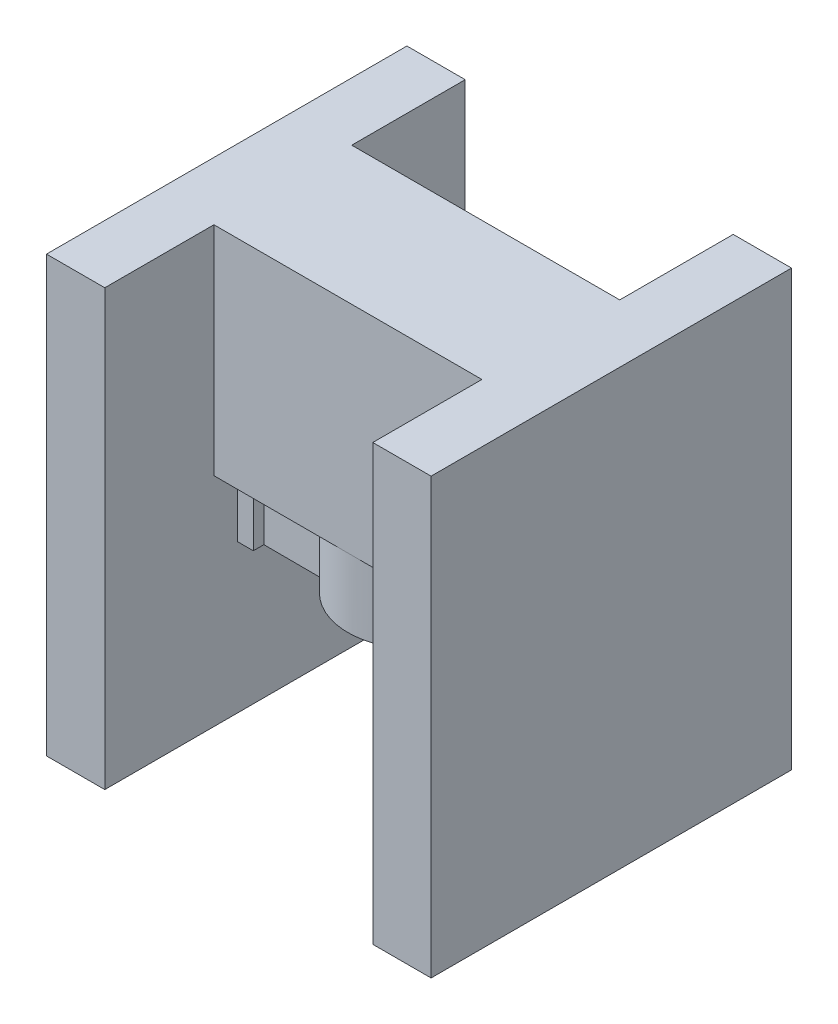
ISO-10303-21;
HEADER;
FILE_DESCRIPTION(('STEP AP214'),'2;1');
FILE_NAME('part.step','',(''),(''),'','','');
FILE_SCHEMA(('AUTOMOTIVE_DESIGN { 1 0 10303 214 1 1 1 1 }'));
ENDSEC;
DATA;
#1=APPLICATION_CONTEXT('core data for automotive mechanical design processes');
#2=APPLICATION_PROTOCOL_DEFINITION('international standard','automotive_design',2000,#1);
#3=PRODUCT_CONTEXT('',#1,'mechanical');
#4=PRODUCT('Part','Part','',(#3));
#5=PRODUCT_RELATED_PRODUCT_CATEGORY('part','',(#4));
#6=PRODUCT_DEFINITION_FORMATION('','',#4);
#7=PRODUCT_DEFINITION_CONTEXT('part definition',#1,'design');
#8=PRODUCT_DEFINITION('design','',#6,#7);
#9=PRODUCT_DEFINITION_SHAPE('','',#8);
#10=(LENGTH_UNIT() NAMED_UNIT(*) SI_UNIT(.MILLI.,.METRE.));
#11=(NAMED_UNIT(*) PLANE_ANGLE_UNIT() SI_UNIT($,.RADIAN.));
#12=(NAMED_UNIT(*) SI_UNIT($,.STERADIAN.) SOLID_ANGLE_UNIT());
#13=UNCERTAINTY_MEASURE_WITH_UNIT(LENGTH_MEASURE(1.E-05),#10,'distance_accuracy_value','');
#14=(GEOMETRIC_REPRESENTATION_CONTEXT(3) GLOBAL_UNCERTAINTY_ASSIGNED_CONTEXT((#13)) GLOBAL_UNIT_ASSIGNED_CONTEXT((#10,
#11,#12)) REPRESENTATION_CONTEXT('',''));
#15=CARTESIAN_POINT('',(0.,0.,0.));
#16=DIRECTION('',(0.,0.,1.));
#17=DIRECTION('',(1.,0.,0.));
#18=AXIS2_PLACEMENT_3D('',#15,#16,#17);
#19=CARTESIAN_POINT('',(19.2722093874877,13.,-34.4308827580366));
#20=DIRECTION('',(-1.,0.,0.));
#21=DIRECTION('',(0.,0.,1.));
#22=AXIS2_PLACEMENT_3D('',#19,#20,#21);
#23=PLANE('',#22);
#24=DIRECTION('',(0.,0.,-1.));
#25=VECTOR('',#24,1.);
#26=CARTESIAN_POINT('',(19.2722093874877,6.5,-34.4308827580366));
#27=LINE('',#26,#25);
#28=CARTESIAN_POINT('',(19.2722093874877,6.5,-33.4308827580366));
#29=VERTEX_POINT('',#28);
#30=CARTESIAN_POINT('',(19.2722093874877,6.5,-34.4308827580366));
#31=VERTEX_POINT('',#30);
#32=EDGE_CURVE('E447',#29,#31,#27,.T.);
#33=ORIENTED_EDGE('',*,*,#32,.F.);
#34=DIRECTION('',(0.,-1.,0.));
#35=VECTOR('',#34,1.);
#36=CARTESIAN_POINT('',(19.2722093874877,13.,-33.4308827580366));
#37=LINE('',#36,#35);
#38=CARTESIAN_POINT('',(19.2722093874877,0.,-33.4308827580366));
#39=VERTEX_POINT('',#38);
#40=EDGE_CURVE('E49',#29,#39,#37,.T.);
#41=ORIENTED_EDGE('',*,*,#40,.T.);
#42=DIRECTION('',(0.,0.,-1.));
#43=VECTOR('',#42,1.);
#44=CARTESIAN_POINT('',(19.2722093874877,0.,-34.4308827580366));
#45=LINE('',#44,#43);
#46=CARTESIAN_POINT('',(19.2722093874877,0.,-34.4308827580366));
#47=VERTEX_POINT('',#46);
#48=EDGE_CURVE('E272',#39,#47,#45,.T.);
#49=ORIENTED_EDGE('',*,*,#48,.T.);
#50=DIRECTION('',(0.,-1.,0.));
#51=VECTOR('',#50,1.);
#52=CARTESIAN_POINT('',(19.2722093874877,13.,-34.4308827580366));
#53=LINE('',#52,#51);
#54=EDGE_CURVE('E351',#31,#47,#53,.T.);
#55=ORIENTED_EDGE('',*,*,#54,.F.);
#56=EDGE_LOOP('',(#33,#41,#49,#55));
#57=FACE_BOUND('',#56,.T.);
#58=ADVANCED_FACE('F32',(#57),#23,.F.);
#59=CARTESIAN_POINT('',(24.8199710298214,13.,-34.4097664918062));
#60=DIRECTION('',(0.00380624017948746,0.,-0.999992756241612));
#61=DIRECTION('',(-0.999992756241612,0.,-0.00380624017948746));
#62=AXIS2_PLACEMENT_3D('',#59,#60,#61);
#63=PLANE('',#62);
#64=DIRECTION('',(0.999992756241612,0.,0.00380624017948746));
#65=VECTOR('',#64,1.);
#66=CARTESIAN_POINT('',(24.8199710298214,6.5,-34.4097664918062));
#67=LINE('',#66,#65);
#68=CARTESIAN_POINT('',(24.8199710298214,6.5,-34.4097664918062));
#69=VERTEX_POINT('',#68);
#70=EDGE_CURVE('E445',#31,#69,#67,.T.);
#71=ORIENTED_EDGE('',*,*,#70,.F.);
#72=ORIENTED_EDGE('',*,*,#54,.T.);
#73=DIRECTION('',(0.999992756241612,0.,0.00380624017948746));
#74=VECTOR('',#73,1.);
#75=CARTESIAN_POINT('',(24.8199710298214,0.,-34.4097664918062));
#76=LINE('',#75,#74);
#77=CARTESIAN_POINT('',(24.8199710298214,0.,-34.4097664918062));
#78=VERTEX_POINT('',#77);
#79=EDGE_CURVE('E274',#47,#78,#76,.T.);
#80=ORIENTED_EDGE('',*,*,#79,.T.);
#81=DIRECTION('',(0.,-1.,0.));
#82=VECTOR('',#81,1.);
#83=CARTESIAN_POINT('',(24.8199710298214,13.,-34.4097664918062));
#84=LINE('',#83,#82);
#85=EDGE_CURVE('E349',#69,#78,#84,.T.);
#86=ORIENTED_EDGE('',*,*,#85,.F.);
#87=EDGE_LOOP('',(#71,#72,#80,#86));
#88=FACE_BOUND('',#87,.T.);
#89=ADVANCED_FACE('F544',(#88),#63,.F.);
#90=CARTESIAN_POINT('',(30.4201919048927,13.,-37.7093916448222));
#91=DIRECTION('',(0.,-1.,0.));
#92=DIRECTION('',(0.,0.,-1.));
#93=AXIS2_PLACEMENT_3D('',#90,#91,#92);
#94=CYLINDRICAL_SURFACE('',#93,6.5);
#95=CARTESIAN_POINT('',(30.4201919048927,6.5,-37.7093916448222));
#96=DIRECTION('',(0.,1.,0.));
#97=DIRECTION('',(0.,0.,1.));
#98=AXIS2_PLACEMENT_3D('',#95,#96,#97);
#99=CIRCLE('',#98,6.5);
#100=CARTESIAN_POINT('',(30.4201919048927,6.5,-31.2093916448222));
#101=VERTEX_POINT('',#100);
#102=CARTESIAN_POINT('',(36.0204127799639,6.5,-34.4097664918062));
#103=VERTEX_POINT('',#102);
#104=EDGE_CURVE('E442',#101,#103,#99,.T.);
#105=ORIENTED_EDGE('',*,*,#104,.F.);
#106=EDGE_CURVE('E443',#69,#101,#99,.T.);
#107=ORIENTED_EDGE('',*,*,#106,.F.);
#108=ORIENTED_EDGE('',*,*,#85,.T.);
#109=CARTESIAN_POINT('',(30.4201919048927,0.,-37.7093916448222));
#110=DIRECTION('',(0.,1.,0.));
#111=DIRECTION('',(0.,0.,1.));
#112=AXIS2_PLACEMENT_3D('',#109,#110,#111);
#113=CIRCLE('',#112,6.5);
#114=CARTESIAN_POINT('',(36.0204127799639,0.,-34.4097664918062));
#115=VERTEX_POINT('',#114);
#116=EDGE_CURVE('E277',#78,#115,#113,.T.);
#117=ORIENTED_EDGE('',*,*,#116,.T.);
#118=DIRECTION('',(0.,-1.,0.));
#119=VECTOR('',#118,1.);
#120=CARTESIAN_POINT('',(36.0204127799639,13.,-34.4097664918062));
#121=LINE('',#120,#119);
#122=EDGE_CURVE('E347',#103,#115,#121,.T.);
#123=ORIENTED_EDGE('',*,*,#122,.F.);
#124=EDGE_LOOP('',(#105,#107,#108,#117,#123));
#125=FACE_BOUND('',#124,.T.);
#126=ADVANCED_FACE('F470',(#125),#94,.T.);
#127=CARTESIAN_POINT('',(36.0204127799639,13.,-34.4097664918062));
#128=DIRECTION('',(-0.00380624017948746,0.,-0.999992756241612));
#129=DIRECTION('',(-0.999992756241612,0.,0.00380624017948746));
#130=AXIS2_PLACEMENT_3D('',#127,#128,#129);
#131=PLANE('',#130);
#132=DIRECTION('',(0.999992756241612,0.,-0.00380624017948746));
#133=VECTOR('',#132,1.);
#134=CARTESIAN_POINT('',(36.0204127799639,6.5,-34.4097664918062));
#135=LINE('',#134,#133);
#136=CARTESIAN_POINT('',(41.5681744222976,6.5,-34.4308827580366));
#137=VERTEX_POINT('',#136);
#138=EDGE_CURVE('E440',#103,#137,#135,.T.);
#139=ORIENTED_EDGE('',*,*,#138,.F.);
#140=ORIENTED_EDGE('',*,*,#122,.T.);
#141=DIRECTION('',(0.999992756241612,0.,-0.00380624017948746));
#142=VECTOR('',#141,1.);
#143=CARTESIAN_POINT('',(36.0204127799639,0.,-34.4097664918062));
#144=LINE('',#143,#142);
#145=CARTESIAN_POINT('',(41.5681744222976,0.,-34.4308827580366));
#146=VERTEX_POINT('',#145);
#147=EDGE_CURVE('E280',#115,#146,#144,.T.);
#148=ORIENTED_EDGE('',*,*,#147,.T.);
#149=DIRECTION('',(0.,-1.,0.));
#150=VECTOR('',#149,1.);
#151=CARTESIAN_POINT('',(41.5681744222976,13.,-34.4308827580366));
#152=LINE('',#151,#150);
#153=EDGE_CURVE('E35',#137,#146,#152,.T.);
#154=ORIENTED_EDGE('',*,*,#153,.F.);
#155=EDGE_LOOP('',(#139,#140,#148,#154));
#156=FACE_BOUND('',#155,.T.);
#157=ADVANCED_FACE('F478',(#156),#131,.F.);
#158=CARTESIAN_POINT('',(41.5681744222976,13.,-34.4308827580366));
#159=DIRECTION('',(1.,0.,0.));
#160=DIRECTION('',(0.,0.,-1.));
#161=AXIS2_PLACEMENT_3D('',#158,#159,#160);
#162=PLANE('',#161);
#163=DIRECTION('',(0.,0.,1.));
#164=VECTOR('',#163,1.);
#165=CARTESIAN_POINT('',(41.5681744222976,6.5,-34.4308827580366));
#166=LINE('',#165,#164);
#167=CARTESIAN_POINT('',(41.5681744222976,6.5,-33.4308827580366));
#168=VERTEX_POINT('',#167);
#169=EDGE_CURVE('E438',#137,#168,#166,.T.);
#170=ORIENTED_EDGE('',*,*,#169,.F.);
#171=ORIENTED_EDGE('',*,*,#153,.T.);
#172=DIRECTION('',(0.,0.,1.));
#173=VECTOR('',#172,1.);
#174=CARTESIAN_POINT('',(41.5681744222976,0.,-34.4308827580366));
#175=LINE('',#174,#173);
#176=CARTESIAN_POINT('',(41.5681744222976,0.,-33.4308827580366));
#177=VERTEX_POINT('',#176);
#178=EDGE_CURVE('E283',#146,#177,#175,.T.);
#179=ORIENTED_EDGE('',*,*,#178,.T.);
#180=DIRECTION('',(0.,-1.,0.));
#181=VECTOR('',#180,1.);
#182=CARTESIAN_POINT('',(41.5681744222976,13.,-33.4308827580366));
#183=LINE('',#182,#181);
#184=EDGE_CURVE('E346',#168,#177,#183,.T.);
#185=ORIENTED_EDGE('',*,*,#184,.F.);
#186=EDGE_LOOP('',(#170,#171,#179,#185));
#187=FACE_BOUND('',#186,.T.);
#188=ADVANCED_FACE('F482',(#187),#162,.F.);
#189=CARTESIAN_POINT('',(43.0606961626799,13.,-33.4308827580366));
#190=DIRECTION('',(0.,0.,-1.));
#191=DIRECTION('',(-1.,0.,0.));
#192=AXIS2_PLACEMENT_3D('',#189,#190,#191);
#193=PLANE('',#192);
#194=DIRECTION('',(1.,0.,0.));
#195=VECTOR('',#194,1.);
#196=CARTESIAN_POINT('',(43.0606961626799,6.5,-33.4308827580366));
#197=LINE('',#196,#195);
#198=CARTESIAN_POINT('',(43.0606961626799,6.5,-33.4308827580366));
#199=VERTEX_POINT('',#198);
#200=EDGE_CURVE('E436',#168,#199,#197,.T.);
#201=ORIENTED_EDGE('',*,*,#200,.F.);
#202=ORIENTED_EDGE('',*,*,#184,.T.);
#203=DIRECTION('',(1.,0.,0.));
#204=VECTOR('',#203,1.);
#205=CARTESIAN_POINT('',(43.0606961626799,0.,-33.4308827580366));
#206=LINE('',#205,#204);
#207=CARTESIAN_POINT('',(43.0606961626799,0.,-33.4308827580366));
#208=VERTEX_POINT('',#207);
#209=EDGE_CURVE('E286',#177,#208,#206,.T.);
#210=ORIENTED_EDGE('',*,*,#209,.T.);
#211=DIRECTION('',(0.,-1.,0.));
#212=VECTOR('',#211,1.);
#213=CARTESIAN_POINT('',(43.0606961626799,13.,-33.4308827580366));
#214=LINE('',#213,#212);
#215=EDGE_CURVE('E344',#199,#208,#214,.T.);
#216=ORIENTED_EDGE('',*,*,#215,.F.);
#217=EDGE_LOOP('',(#201,#202,#210,#216));
#218=FACE_BOUND('',#217,.T.);
#219=ADVANCED_FACE('F489',(#218),#193,.F.);
#220=CARTESIAN_POINT('',(43.0606961626799,13.,-42.2352624916838));
#221=DIRECTION('',(0.,0.,1.));
#222=DIRECTION('',(1.,0.,0.));
#223=AXIS2_PLACEMENT_3D('',#220,#221,#222);
#224=PLANE('',#223);
#225=DIRECTION('',(-1.,0.,0.));
#226=VECTOR('',#225,1.);
#227=CARTESIAN_POINT('',(43.0606961626799,6.5,-42.2352624916838));
#228=LINE('',#227,#226);
#229=CARTESIAN_POINT('',(43.0606961626799,6.5,-42.2352624916838));
#230=VERTEX_POINT('',#229);
#231=CARTESIAN_POINT('',(41.5681744222976,6.5,-42.2352624916838));
#232=VERTEX_POINT('',#231);
#233=EDGE_CURVE('E418',#230,#232,#228,.T.);
#234=ORIENTED_EDGE('',*,*,#233,.F.);
#235=DIRECTION('',(0.,-1.,0.));
#236=VECTOR('',#235,1.);
#237=CARTESIAN_POINT('',(43.0606961626799,13.,-42.2352624916838));
#238=LINE('',#237,#236);
#239=CARTESIAN_POINT('',(43.0606961626799,0.,-42.2352624916838));
#240=VERTEX_POINT('',#239);
#241=EDGE_CURVE('E333',#230,#240,#238,.T.);
#242=ORIENTED_EDGE('',*,*,#241,.T.);
#243=DIRECTION('',(-1.,0.,0.));
#244=VECTOR('',#243,1.);
#245=CARTESIAN_POINT('',(43.0606961626799,0.,-42.2352624916838));
#246=LINE('',#245,#244);
#247=CARTESIAN_POINT('',(41.5681744222976,0.,-42.2352624916838));
#248=VERTEX_POINT('',#247);
#249=EDGE_CURVE('E289',#240,#248,#246,.T.);
#250=ORIENTED_EDGE('',*,*,#249,.T.);
#251=DIRECTION('',(0.,-1.,0.));
#252=VECTOR('',#251,1.);
#253=CARTESIAN_POINT('',(41.5681744222976,13.,-42.2352624916838));
#254=LINE('',#253,#252);
#255=EDGE_CURVE('E336',#232,#248,#254,.T.);
#256=ORIENTED_EDGE('',*,*,#255,.F.);
#257=EDGE_LOOP('',(#234,#242,#250,#256));
#258=FACE_BOUND('',#257,.T.);
#259=ADVANCED_FACE('F503',(#258),#224,.F.);
#260=CARTESIAN_POINT('',(41.5681744222976,13.,-42.2352624916838));
#261=DIRECTION('',(1.,0.,0.));
#262=DIRECTION('',(0.,0.,-1.));
#263=AXIS2_PLACEMENT_3D('',#260,#261,#262);
#264=PLANE('',#263);
#265=DIRECTION('',(0.,0.,1.));
#266=VECTOR('',#265,1.);
#267=CARTESIAN_POINT('',(41.5681744222976,6.5,-42.2352624916838));
#268=LINE('',#267,#266);
#269=CARTESIAN_POINT('',(41.5681744222976,6.5,-40.8600221258481));
#270=VERTEX_POINT('',#269);
#271=EDGE_CURVE('E420',#232,#270,#268,.T.);
#272=ORIENTED_EDGE('',*,*,#271,.F.);
#273=ORIENTED_EDGE('',*,*,#255,.T.);
#274=DIRECTION('',(0.,0.,1.));
#275=VECTOR('',#274,1.);
#276=CARTESIAN_POINT('',(41.5681744222976,0.,-42.2352624916838));
#277=LINE('',#276,#275);
#278=CARTESIAN_POINT('',(41.5681744222976,0.,-40.8600221258481));
#279=VERTEX_POINT('',#278);
#280=EDGE_CURVE('E292',#248,#279,#277,.T.);
#281=ORIENTED_EDGE('',*,*,#280,.T.);
#282=DIRECTION('',(0.,-1.,0.));
#283=VECTOR('',#282,1.);
#284=CARTESIAN_POINT('',(41.5681744222976,13.,-40.8600221258481));
#285=LINE('',#284,#283);
#286=EDGE_CURVE('E332',#270,#279,#285,.T.);
#287=ORIENTED_EDGE('',*,*,#286,.F.);
#288=EDGE_LOOP('',(#272,#273,#281,#287));
#289=FACE_BOUND('',#288,.T.);
#290=ADVANCED_FACE('F576',(#289),#264,.F.);
#291=CARTESIAN_POINT('',(41.5681744222976,13.,-40.8600221258481));
#292=DIRECTION('',(0.,0.,1.));
#293=DIRECTION('',(1.,0.,0.));
#294=AXIS2_PLACEMENT_3D('',#291,#292,#293);
#295=PLANE('',#294);
#296=DIRECTION('',(-1.,0.,0.));
#297=VECTOR('',#296,1.);
#298=CARTESIAN_POINT('',(41.5681744222976,6.5,-40.8600221258481));
#299=LINE('',#298,#297);
#300=CARTESIAN_POINT('',(36.1055703067258,6.5,-40.8600221258481));
#301=VERTEX_POINT('',#300);
#302=EDGE_CURVE('E422',#270,#301,#299,.T.);
#303=ORIENTED_EDGE('',*,*,#302,.F.);
#304=ORIENTED_EDGE('',*,*,#286,.T.);
#305=DIRECTION('',(-1.,0.,0.));
#306=VECTOR('',#305,1.);
#307=CARTESIAN_POINT('',(41.5681744222976,0.,-40.8600221258481));
#308=LINE('',#307,#306);
#309=CARTESIAN_POINT('',(36.1055703067258,0.,-40.8600221258481));
#310=VERTEX_POINT('',#309);
#311=EDGE_CURVE('E295',#279,#310,#308,.T.);
#312=ORIENTED_EDGE('',*,*,#311,.T.);
#313=DIRECTION('',(0.,-1.,0.));
#314=VECTOR('',#313,1.);
#315=CARTESIAN_POINT('',(36.1055703067258,13.,-40.8600221258481));
#316=LINE('',#315,#314);
#317=EDGE_CURVE('E330',#301,#310,#316,.T.);
#318=ORIENTED_EDGE('',*,*,#317,.F.);
#319=EDGE_LOOP('',(#303,#304,#312,#318));
#320=FACE_BOUND('',#319,.T.);
#321=ADVANCED_FACE('F579',(#320),#295,.F.);
#322=CARTESIAN_POINT('',(30.4201919048927,13.,-37.7093916448222));
#323=DIRECTION('',(0.,-1.,0.));
#324=DIRECTION('',(0.,0.,-1.));
#325=AXIS2_PLACEMENT_3D('',#322,#323,#324);
#326=CYLINDRICAL_SURFACE('',#325,6.5);
#327=CARTESIAN_POINT('',(30.4201919048927,6.5,-37.7093916448222));
#328=DIRECTION('',(0.,1.,0.));
#329=DIRECTION('',(0.,0.,1.));
#330=AXIS2_PLACEMENT_3D('',#327,#328,#329);
#331=CIRCLE('',#330,6.5);
#332=CARTESIAN_POINT('',(30.4201919048927,6.5,-44.2093916448222));
#333=VERTEX_POINT('',#332);
#334=EDGE_CURVE('E424',#301,#333,#331,.T.);
#335=ORIENTED_EDGE('',*,*,#334,.F.);
#336=ORIENTED_EDGE('',*,*,#317,.T.);
#337=CARTESIAN_POINT('',(30.4201919048927,0.,-37.7093916448222));
#338=DIRECTION('',(0.,1.,0.));
#339=DIRECTION('',(0.,0.,1.));
#340=AXIS2_PLACEMENT_3D('',#337,#338,#339);
#341=CIRCLE('',#340,6.5);
#342=CARTESIAN_POINT('',(24.7348135030595,0.,-40.8600221258481));
#343=VERTEX_POINT('',#342);
#344=EDGE_CURVE('E298',#310,#343,#341,.T.);
#345=ORIENTED_EDGE('',*,*,#344,.T.);
#346=DIRECTION('',(0.,-1.,0.));
#347=VECTOR('',#346,1.);
#348=CARTESIAN_POINT('',(24.7348135030595,13.,-40.8600221258481));
#349=LINE('',#348,#347);
#350=CARTESIAN_POINT('',(24.7348135030596,6.5,-40.8600221258481));
#351=VERTEX_POINT('',#350);
#352=EDGE_CURVE('E328',#351,#343,#349,.T.);
#353=ORIENTED_EDGE('',*,*,#352,.F.);
#354=EDGE_CURVE('E425',#333,#351,#331,.T.);
#355=ORIENTED_EDGE('',*,*,#354,.F.);
#356=EDGE_LOOP('',(#335,#336,#345,#353,#355));
#357=FACE_BOUND('',#356,.T.);
#358=ADVANCED_FACE('F517',(#357),#326,.T.);
#359=CARTESIAN_POINT('',(19.2722093874877,13.,-40.8600221258481));
#360=DIRECTION('',(0.,0.,1.));
#361=DIRECTION('',(1.,0.,0.));
#362=AXIS2_PLACEMENT_3D('',#359,#360,#361);
#363=PLANE('',#362);
#364=DIRECTION('',(-1.,0.,0.));
#365=VECTOR('',#364,1.);
#366=CARTESIAN_POINT('',(19.2722093874877,6.5,-40.8600221258481));
#367=LINE('',#366,#365);
#368=CARTESIAN_POINT('',(19.2722093874877,6.5,-40.8600221258481));
#369=VERTEX_POINT('',#368);
#370=EDGE_CURVE('E427',#351,#369,#367,.T.);
#371=ORIENTED_EDGE('',*,*,#370,.F.);
#372=ORIENTED_EDGE('',*,*,#352,.T.);
#373=DIRECTION('',(-1.,0.,0.));
#374=VECTOR('',#373,1.);
#375=CARTESIAN_POINT('',(19.2722093874877,0.,-40.8600221258481));
#376=LINE('',#375,#374);
#377=CARTESIAN_POINT('',(19.2722093874877,0.,-40.8600221258481));
#378=VERTEX_POINT('',#377);
#379=EDGE_CURVE('E301',#343,#378,#376,.T.);
#380=ORIENTED_EDGE('',*,*,#379,.T.);
#381=DIRECTION('',(0.,-1.,0.));
#382=VECTOR('',#381,1.);
#383=CARTESIAN_POINT('',(19.2722093874877,13.,-40.8600221258481));
#384=LINE('',#383,#382);
#385=EDGE_CURVE('E326',#369,#378,#384,.T.);
#386=ORIENTED_EDGE('',*,*,#385,.F.);
#387=EDGE_LOOP('',(#371,#372,#380,#386));
#388=FACE_BOUND('',#387,.T.);
#389=ADVANCED_FACE('F525',(#388),#363,.F.);
#390=CARTESIAN_POINT('',(19.2722093874877,13.,-42.2352624916838));
#391=DIRECTION('',(-1.,0.,0.));
#392=DIRECTION('',(0.,0.,1.));
#393=AXIS2_PLACEMENT_3D('',#390,#391,#392);
#394=PLANE('',#393);
#395=DIRECTION('',(0.,0.,-1.));
#396=VECTOR('',#395,1.);
#397=CARTESIAN_POINT('',(19.2722093874877,6.5,-42.2352624916838));
#398=LINE('',#397,#396);
#399=CARTESIAN_POINT('',(19.2722093874877,6.5,-42.2352624916838));
#400=VERTEX_POINT('',#399);
#401=EDGE_CURVE('E429',#369,#400,#398,.T.);
#402=ORIENTED_EDGE('',*,*,#401,.F.);
#403=ORIENTED_EDGE('',*,*,#385,.T.);
#404=DIRECTION('',(0.,0.,-1.));
#405=VECTOR('',#404,1.);
#406=CARTESIAN_POINT('',(19.2722093874877,0.,-42.2352624916838));
#407=LINE('',#406,#405);
#408=CARTESIAN_POINT('',(19.2722093874877,0.,-42.2352624916838));
#409=VERTEX_POINT('',#408);
#410=EDGE_CURVE('E304',#378,#409,#407,.T.);
#411=ORIENTED_EDGE('',*,*,#410,.T.);
#412=DIRECTION('',(0.,-1.,0.));
#413=VECTOR('',#412,1.);
#414=CARTESIAN_POINT('',(19.2722093874877,13.,-42.2352624916838));
#415=LINE('',#414,#413);
#416=EDGE_CURVE('E324',#400,#409,#415,.T.);
#417=ORIENTED_EDGE('',*,*,#416,.F.);
#418=EDGE_LOOP('',(#402,#403,#411,#417));
#419=FACE_BOUND('',#418,.T.);
#420=ADVANCED_FACE('F529',(#419),#394,.F.);
#421=CARTESIAN_POINT('',(17.7796876471054,13.,-42.2352624916838));
#422=DIRECTION('',(0.,0.,1.));
#423=DIRECTION('',(1.,0.,0.));
#424=AXIS2_PLACEMENT_3D('',#421,#422,#423);
#425=PLANE('',#424);
#426=DIRECTION('',(-1.,0.,0.));
#427=VECTOR('',#426,1.);
#428=CARTESIAN_POINT('',(17.7796876471054,6.5,-42.2352624916838));
#429=LINE('',#428,#427);
#430=CARTESIAN_POINT('',(17.7796876471054,6.5,-42.2352624916838));
#431=VERTEX_POINT('',#430);
#432=EDGE_CURVE('E431',#400,#431,#429,.T.);
#433=ORIENTED_EDGE('',*,*,#432,.F.);
#434=ORIENTED_EDGE('',*,*,#416,.T.);
#435=DIRECTION('',(-1.,0.,0.));
#436=VECTOR('',#435,1.);
#437=CARTESIAN_POINT('',(17.7796876471054,0.,-42.2352624916838));
#438=LINE('',#437,#436);
#439=CARTESIAN_POINT('',(17.7796876471054,0.,-42.2352624916838));
#440=VERTEX_POINT('',#439);
#441=EDGE_CURVE('E307',#409,#440,#438,.T.);
#442=ORIENTED_EDGE('',*,*,#441,.T.);
#443=DIRECTION('',(0.,-1.,0.));
#444=VECTOR('',#443,1.);
#445=CARTESIAN_POINT('',(17.7796876471054,13.,-42.2352624916838));
#446=LINE('',#445,#444);
#447=EDGE_CURVE('E322',#431,#440,#446,.T.);
#448=ORIENTED_EDGE('',*,*,#447,.F.);
#449=EDGE_LOOP('',(#433,#434,#442,#448));
#450=FACE_BOUND('',#449,.T.);
#451=ADVANCED_FACE('F536',(#450),#425,.F.);
#452=CARTESIAN_POINT('',(17.7796876471054,13.,-33.4308827580366));
#453=DIRECTION('',(0.,0.,-1.));
#454=DIRECTION('',(-1.,0.,0.));
#455=AXIS2_PLACEMENT_3D('',#452,#453,#454);
#456=PLANE('',#455);
#457=DIRECTION('',(1.,0.,0.));
#458=VECTOR('',#457,1.);
#459=CARTESIAN_POINT('',(17.7796876471054,6.5,-33.4308827580366));
#460=LINE('',#459,#458);
#461=CARTESIAN_POINT('',(17.7796876471054,6.5,-33.4308827580366));
#462=VERTEX_POINT('',#461);
#463=EDGE_CURVE('E11',#462,#29,#460,.T.);
#464=ORIENTED_EDGE('',*,*,#463,.F.);
#465=DIRECTION('',(0.,-1.,0.));
#466=VECTOR('',#465,1.);
#467=CARTESIAN_POINT('',(17.7796876471054,13.,-33.4308827580366));
#468=LINE('',#467,#466);
#469=CARTESIAN_POINT('',(17.7796876471054,0.,-33.4308827580366));
#470=VERTEX_POINT('',#469);
#471=EDGE_CURVE('E56',#462,#470,#468,.T.);
#472=ORIENTED_EDGE('',*,*,#471,.T.);
#473=DIRECTION('',(1.,0.,0.));
#474=VECTOR('',#473,1.);
#475=CARTESIAN_POINT('',(17.7796876471054,0.,-33.4308827580366));
#476=LINE('',#475,#474);
#477=EDGE_CURVE('E310',#470,#39,#476,.T.);
#478=ORIENTED_EDGE('',*,*,#477,.T.);
#479=ORIENTED_EDGE('',*,*,#40,.F.);
#480=EDGE_LOOP('',(#464,#472,#478,#479));
#481=FACE_BOUND('',#480,.T.);
#482=ADVANCED_FACE('F539',(#481),#456,.F.);
#483=CARTESIAN_POINT('',(30.4201919048927,0.,-37.7093916448222));
#484=DIRECTION('',(0.,1.,0.));
#485=DIRECTION('',(0.,0.,1.));
#486=AXIS2_PLACEMENT_3D('',#483,#484,#485);
#487=PLANE('',#486);
#488=CARTESIAN_POINT('',(30.4201919048927,0.,-37.7093916448222));
#489=DIRECTION('',(0.,1.,0.));
#490=DIRECTION('',(0.,0.,1.));
#491=AXIS2_PLACEMENT_3D('',#488,#489,#490);
#492=CIRCLE('',#491,2.00000000000001);
#493=CARTESIAN_POINT('',(30.4201919048927,0.,-35.7093916448222));
#494=VERTEX_POINT('',#493);
#495=EDGE_CURVE('E41',#494,#494,#492,.F.);
#496=ORIENTED_EDGE('',*,*,#495,.F.);
#497=EDGE_LOOP('',(#496));
#498=FACE_BOUND('',#497,.T.);
#499=DIRECTION('',(0.,0.,-1.));
#500=VECTOR('',#499,1.);
#501=CARTESIAN_POINT('',(43.0606961626799,0.,-20.9144431425172));
#502=LINE('',#501,#500);
#503=EDGE_CURVE('E400',#208,#240,#502,.T.);
#504=ORIENTED_EDGE('',*,*,#503,.F.);
#505=ORIENTED_EDGE('',*,*,#209,.F.);
#506=ORIENTED_EDGE('',*,*,#178,.F.);
#507=ORIENTED_EDGE('',*,*,#147,.F.);
#508=ORIENTED_EDGE('',*,*,#116,.F.);
#509=ORIENTED_EDGE('',*,*,#79,.F.);
#510=ORIENTED_EDGE('',*,*,#48,.F.);
#511=ORIENTED_EDGE('',*,*,#477,.F.);
#512=DIRECTION('',(0.,0.,1.));
#513=VECTOR('',#512,1.);
#514=CARTESIAN_POINT('',(17.7796876471054,0.,-54.9144431425172));
#515=LINE('',#514,#513);
#516=EDGE_CURVE('E352',#440,#470,#515,.T.);
#517=ORIENTED_EDGE('',*,*,#516,.F.);
#518=ORIENTED_EDGE('',*,*,#441,.F.);
#519=ORIENTED_EDGE('',*,*,#410,.F.);
#520=ORIENTED_EDGE('',*,*,#379,.F.);
#521=ORIENTED_EDGE('',*,*,#344,.F.);
#522=ORIENTED_EDGE('',*,*,#311,.F.);
#523=ORIENTED_EDGE('',*,*,#280,.F.);
#524=ORIENTED_EDGE('',*,*,#249,.F.);
#525=EDGE_LOOP('',(#504,#505,#506,#507,#508,#509,#510,#511,#517,#518,#519,#520,#521,#522,#523,#524));
#526=FACE_BOUND('',#525,.T.);
#527=ADVANCED_FACE('F497',(#498,#526),#487,.F.);
#528=CARTESIAN_POINT('',(43.0606961626799,13.,-20.9144431425172));
#529=DIRECTION('',(0.,0.,-1.));
#530=DIRECTION('',(-1.,0.,0.));
#531=AXIS2_PLACEMENT_3D('',#528,#529,#530);
#532=PLANE('',#531);
#533=DIRECTION('',(0.,-1.,0.));
#534=VECTOR('',#533,1.);
#535=CARTESIAN_POINT('',(43.0606961626799,13.,-20.9144431425172));
#536=LINE('',#535,#534);
#537=CARTESIAN_POINT('',(43.0606961626799,27.,-20.9144431425172));
#538=VERTEX_POINT('',#537);
#539=CARTESIAN_POINT('',(43.0606961626799,-14.,-20.9144431425172));
#540=VERTEX_POINT('',#539);
#541=EDGE_CURVE('E342',#538,#540,#536,.T.);
#542=ORIENTED_EDGE('',*,*,#541,.T.);
#543=DIRECTION('',(-1.,0.,0.));
#544=VECTOR('',#543,1.);
#545=CARTESIAN_POINT('',(48.5606961626799,-14.,-20.9144431425172));
#546=LINE('',#545,#544);
#547=CARTESIAN_POINT('',(48.5606961626799,-14.,-20.9144431425172));
#548=VERTEX_POINT('',#547);
#549=EDGE_CURVE('E403',#548,#540,#546,.T.);
#550=ORIENTED_EDGE('',*,*,#549,.F.);
#551=DIRECTION('',(0.,-1.,0.));
#552=VECTOR('',#551,1.);
#553=CARTESIAN_POINT('',(48.5606961626799,13.,-20.9144431425172));
#554=LINE('',#553,#552);
#555=CARTESIAN_POINT('',(48.5606961626799,27.,-20.9144431425172));
#556=VERTEX_POINT('',#555);
#557=EDGE_CURVE('E340',#556,#548,#554,.T.);
#558=ORIENTED_EDGE('',*,*,#557,.F.);
#559=DIRECTION('',(1.,0.,0.));
#560=VECTOR('',#559,1.);
#561=CARTESIAN_POINT('',(48.5606961626799,27.,-20.9144431425172));
#562=LINE('',#561,#560);
#563=EDGE_CURVE('E254',#538,#556,#562,.T.);
#564=ORIENTED_EDGE('',*,*,#563,.F.);
#565=EDGE_LOOP('',(#542,#550,#558,#564));
#566=FACE_BOUND('',#565,.T.);
#567=ADVANCED_FACE('F559',(#566),#532,.F.);
#568=CARTESIAN_POINT('',(48.5606961626799,13.,-20.9144431425172));
#569=DIRECTION('',(-1.,0.,0.));
#570=DIRECTION('',(0.,0.,1.));
#571=AXIS2_PLACEMENT_3D('',#568,#569,#570);
#572=PLANE('',#571);
#573=DIRECTION('',(0.,-1.,0.));
#574=VECTOR('',#573,1.);
#575=CARTESIAN_POINT('',(48.5606961626799,13.,-54.9144431425172));
#576=LINE('',#575,#574);
#577=CARTESIAN_POINT('',(48.5606961626799,27.,-54.9144431425172));
#578=VERTEX_POINT('',#577);
#579=CARTESIAN_POINT('',(48.5606961626799,-14.,-54.9144431425172));
#580=VERTEX_POINT('',#579);
#581=EDGE_CURVE('E338',#578,#580,#576,.T.);
#582=ORIENTED_EDGE('',*,*,#581,.F.);
#583=DIRECTION('',(0.,0.,-1.));
#584=VECTOR('',#583,1.);
#585=CARTESIAN_POINT('',(48.5606961626799,27.,-54.9144431425172));
#586=LINE('',#585,#584);
#587=EDGE_CURVE('E262',#556,#578,#586,.T.);
#588=ORIENTED_EDGE('',*,*,#587,.F.);
#589=ORIENTED_EDGE('',*,*,#557,.T.);
#590=DIRECTION('',(0.,0.,1.));
#591=VECTOR('',#590,1.);
#592=CARTESIAN_POINT('',(48.5606961626799,-14.,-54.9144431425172));
#593=LINE('',#592,#591);
#594=EDGE_CURVE('E399',#580,#548,#593,.T.);
#595=ORIENTED_EDGE('',*,*,#594,.F.);
#596=EDGE_LOOP('',(#582,#588,#589,#595));
#597=FACE_BOUND('',#596,.T.);
#598=ADVANCED_FACE('F562',(#597),#572,.F.);
#599=CARTESIAN_POINT('',(48.5606961626799,13.,-54.9144431425172));
#600=DIRECTION('',(0.,0.,1.));
#601=DIRECTION('',(1.,0.,0.));
#602=AXIS2_PLACEMENT_3D('',#599,#600,#601);
#603=PLANE('',#602);
#604=ORIENTED_EDGE('',*,*,#581,.T.);
#605=DIRECTION('',(1.,0.,0.));
#606=VECTOR('',#605,1.);
#607=CARTESIAN_POINT('',(43.0606961626799,-14.,-54.9144431425172));
#608=LINE('',#607,#606);
#609=CARTESIAN_POINT('',(43.0606961626799,-14.,-54.9144431425172));
#610=VERTEX_POINT('',#609);
#611=EDGE_CURVE('E407',#610,#580,#608,.T.);
#612=ORIENTED_EDGE('',*,*,#611,.F.);
#613=DIRECTION('',(0.,-1.,0.));
#614=VECTOR('',#613,1.);
#615=CARTESIAN_POINT('',(43.0606961626799,13.,-54.9144431425172));
#616=LINE('',#615,#614);
#617=CARTESIAN_POINT('',(43.0606961626799,27.,-54.9144431425172));
#618=VERTEX_POINT('',#617);
#619=EDGE_CURVE('E335',#618,#610,#616,.T.);
#620=ORIENTED_EDGE('',*,*,#619,.F.);
#621=DIRECTION('',(-1.,0.,0.));
#622=VECTOR('',#621,1.);
#623=CARTESIAN_POINT('',(43.0606961626799,27.,-54.9144431425172));
#624=LINE('',#623,#622);
#625=EDGE_CURVE('E264',#578,#618,#624,.T.);
#626=ORIENTED_EDGE('',*,*,#625,.F.);
#627=EDGE_LOOP('',(#604,#612,#620,#626));
#628=FACE_BOUND('',#627,.T.);
#629=ADVANCED_FACE('F566',(#628),#603,.F.);
#630=CARTESIAN_POINT('',(43.0606961626799,13.,-54.9144431425172));
#631=DIRECTION('',(1.,0.,0.));
#632=DIRECTION('',(0.,0.,-1.));
#633=AXIS2_PLACEMENT_3D('',#630,#631,#632);
#634=PLANE('',#633);
#635=DIRECTION('',(0.,0.,1.));
#636=VECTOR('',#635,1.);
#637=CARTESIAN_POINT('',(43.0606961626799,6.5,-54.9144431425172));
#638=LINE('',#637,#636);
#639=CARTESIAN_POINT('',(43.0606961626799,6.5,-44.2093916448222));
#640=VERTEX_POINT('',#639);
#641=EDGE_CURVE('E417',#640,#230,#638,.T.);
#642=ORIENTED_EDGE('',*,*,#641,.F.);
#643=DIRECTION('',(0.,1.,0.));
#644=VECTOR('',#643,1.);
#645=CARTESIAN_POINT('',(43.0606961626799,13.,-44.2093916448222));
#646=LINE('',#645,#644);
#647=CARTESIAN_POINT('',(43.0606961626799,27.,-44.2093916448222));
#648=VERTEX_POINT('',#647);
#649=EDGE_CURVE('E450',#640,#648,#646,.T.);
#650=ORIENTED_EDGE('',*,*,#649,.T.);
#651=DIRECTION('',(0.,0.,1.));
#652=VECTOR('',#651,1.);
#653=CARTESIAN_POINT('',(43.0606961626799,27.,-42.2352624916838));
#654=LINE('',#653,#652);
#655=EDGE_CURVE('E267',#618,#648,#654,.T.);
#656=ORIENTED_EDGE('',*,*,#655,.F.);
#657=ORIENTED_EDGE('',*,*,#619,.T.);
#658=DIRECTION('',(0.,0.,-1.));
#659=VECTOR('',#658,1.);
#660=CARTESIAN_POINT('',(43.0606961626799,-14.,-20.9144431425172));
#661=LINE('',#660,#659);
#662=EDGE_CURVE('E410',#540,#610,#661,.T.);
#663=ORIENTED_EDGE('',*,*,#662,.F.);
#664=ORIENTED_EDGE('',*,*,#541,.F.);
#665=DIRECTION('',(0.,0.,1.));
#666=VECTOR('',#665,1.);
#667=CARTESIAN_POINT('',(43.0606961626799,27.,-20.9144431425172));
#668=LINE('',#667,#666);
#669=CARTESIAN_POINT('',(43.0606961626799,27.,-31.2093916448222));
#670=VERTEX_POINT('',#669);
#671=EDGE_CURVE('E252',#670,#538,#668,.T.);
#672=ORIENTED_EDGE('',*,*,#671,.F.);
#673=DIRECTION('',(0.,-1.,0.));
#674=VECTOR('',#673,1.);
#675=CARTESIAN_POINT('',(43.0606961626799,13.,-31.2093916448222));
#676=LINE('',#675,#674);
#677=CARTESIAN_POINT('',(43.0606961626799,6.5,-31.2093916448222));
#678=VERTEX_POINT('',#677);
#679=EDGE_CURVE('E234',#670,#678,#676,.T.);
#680=ORIENTED_EDGE('',*,*,#679,.T.);
#681=EDGE_CURVE('E434',#199,#678,#638,.T.);
#682=ORIENTED_EDGE('',*,*,#681,.F.);
#683=ORIENTED_EDGE('',*,*,#215,.T.);
#684=ORIENTED_EDGE('',*,*,#503,.T.);
#685=ORIENTED_EDGE('',*,*,#241,.F.);
#686=EDGE_LOOP('',(#642,#650,#656,#657,#663,#664,#672,#680,#682,#683,#684,#685));
#687=FACE_BOUND('',#686,.T.);
#688=ADVANCED_FACE('F493',(#687),#634,.F.);
#689=CARTESIAN_POINT('',(12.2796876471054,13.,-54.9144431425172));
#690=DIRECTION('',(0.,0.,1.));
#691=DIRECTION('',(1.,0.,0.));
#692=AXIS2_PLACEMENT_3D('',#689,#690,#691);
#693=PLANE('',#692);
#694=DIRECTION('',(0.,-1.,0.));
#695=VECTOR('',#694,1.);
#696=CARTESIAN_POINT('',(17.7796876471054,13.,-54.9144431425172));
#697=LINE('',#696,#695);
#698=CARTESIAN_POINT('',(17.7796876471054,27.,-54.9144431425172));
#699=VERTEX_POINT('',#698);
#700=CARTESIAN_POINT('',(17.7796876471054,-14.,-54.9144431425172));
#701=VERTEX_POINT('',#700);
#702=EDGE_CURVE('E320',#699,#701,#697,.T.);
#703=ORIENTED_EDGE('',*,*,#702,.T.);
#704=DIRECTION('',(1.,0.,0.));
#705=VECTOR('',#704,1.);
#706=CARTESIAN_POINT('',(12.2796876471054,-14.,-54.9144431425172));
#707=LINE('',#706,#705);
#708=CARTESIAN_POINT('',(12.2796876471054,-14.,-54.9144431425172));
#709=VERTEX_POINT('',#708);
#710=EDGE_CURVE('E395',#709,#701,#707,.T.);
#711=ORIENTED_EDGE('',*,*,#710,.F.);
#712=DIRECTION('',(0.,-1.,0.));
#713=VECTOR('',#712,1.);
#714=CARTESIAN_POINT('',(12.2796876471054,13.,-54.9144431425172));
#715=LINE('',#714,#713);
#716=CARTESIAN_POINT('',(12.2796876471054,27.,-54.9144431425172));
#717=VERTEX_POINT('',#716);
#718=EDGE_CURVE('E318',#717,#709,#715,.T.);
#719=ORIENTED_EDGE('',*,*,#718,.F.);
#720=DIRECTION('',(-1.,0.,0.));
#721=VECTOR('',#720,1.);
#722=CARTESIAN_POINT('',(17.7796876471054,27.,-54.9144431425172));
#723=LINE('',#722,#721);
#724=EDGE_CURVE('E373',#699,#717,#723,.T.);
#725=ORIENTED_EDGE('',*,*,#724,.F.);
#726=EDGE_LOOP('',(#703,#711,#719,#725));
#727=FACE_BOUND('',#726,.T.);
#728=ADVANCED_FACE('F573',(#727),#693,.F.);
#729=CARTESIAN_POINT('',(12.2796876471054,13.,-20.9144431425172));
#730=DIRECTION('',(1.,0.,0.));
#731=DIRECTION('',(0.,0.,-1.));
#732=AXIS2_PLACEMENT_3D('',#729,#730,#731);
#733=PLANE('',#732);
#734=DIRECTION('',(0.,-1.,0.));
#735=VECTOR('',#734,1.);
#736=CARTESIAN_POINT('',(12.2796876471054,13.,-20.9144431425172));
#737=LINE('',#736,#735);
#738=CARTESIAN_POINT('',(12.2796876471054,27.,-20.9144431425172));
#739=VERTEX_POINT('',#738);
#740=CARTESIAN_POINT('',(12.2796876471054,-14.,-20.9144431425172));
#741=VERTEX_POINT('',#740);
#742=EDGE_CURVE('E316',#739,#741,#737,.T.);
#743=ORIENTED_EDGE('',*,*,#742,.F.);
#744=DIRECTION('',(0.,0.,1.));
#745=VECTOR('',#744,1.);
#746=CARTESIAN_POINT('',(12.2796876471054,27.,-54.9144431425172));
#747=LINE('',#746,#745);
#748=EDGE_CURVE('E256',#717,#739,#747,.T.);
#749=ORIENTED_EDGE('',*,*,#748,.F.);
#750=ORIENTED_EDGE('',*,*,#718,.T.);
#751=DIRECTION('',(0.,0.,-1.));
#752=VECTOR('',#751,1.);
#753=CARTESIAN_POINT('',(12.2796876471054,-14.,-20.9144431425172));
#754=LINE('',#753,#752);
#755=EDGE_CURVE('E382',#741,#709,#754,.T.);
#756=ORIENTED_EDGE('',*,*,#755,.F.);
#757=EDGE_LOOP('',(#743,#749,#750,#756));
#758=FACE_BOUND('',#757,.T.);
#759=ADVANCED_FACE('F380',(#758),#733,.F.);
#760=CARTESIAN_POINT('',(17.7796876471054,13.,-20.9144431425172));
#761=DIRECTION('',(0.,0.,-1.));
#762=DIRECTION('',(-1.,0.,0.));
#763=AXIS2_PLACEMENT_3D('',#760,#761,#762);
#764=PLANE('',#763);
#765=ORIENTED_EDGE('',*,*,#742,.T.);
#766=DIRECTION('',(-1.,0.,0.));
#767=VECTOR('',#766,1.);
#768=CARTESIAN_POINT('',(17.7796876471054,-14.,-20.9144431425172));
#769=LINE('',#768,#767);
#770=CARTESIAN_POINT('',(17.7796876471054,-14.,-20.9144431425172));
#771=VERTEX_POINT('',#770);
#772=EDGE_CURVE('E387',#771,#741,#769,.T.);
#773=ORIENTED_EDGE('',*,*,#772,.F.);
#774=DIRECTION('',(0.,-1.,0.));
#775=VECTOR('',#774,1.);
#776=CARTESIAN_POINT('',(17.7796876471054,13.,-20.9144431425172));
#777=LINE('',#776,#775);
#778=CARTESIAN_POINT('',(17.7796876471054,27.,-20.9144431425172));
#779=VERTEX_POINT('',#778);
#780=EDGE_CURVE('E314',#779,#771,#777,.T.);
#781=ORIENTED_EDGE('',*,*,#780,.F.);
#782=DIRECTION('',(1.,0.,0.));
#783=VECTOR('',#782,1.);
#784=CARTESIAN_POINT('',(12.2796876471054,27.,-20.9144431425172));
#785=LINE('',#784,#783);
#786=EDGE_CURVE('E251',#739,#779,#785,.T.);
#787=ORIENTED_EDGE('',*,*,#786,.F.);
#788=EDGE_LOOP('',(#765,#773,#781,#787));
#789=FACE_BOUND('',#788,.T.);
#790=ADVANCED_FACE('F386',(#789),#764,.F.);
#791=CARTESIAN_POINT('',(17.7796876471054,13.,-33.4308827580366));
#792=DIRECTION('',(-1.,0.,0.));
#793=DIRECTION('',(0.,0.,1.));
#794=AXIS2_PLACEMENT_3D('',#791,#792,#793);
#795=PLANE('',#794);
#796=DIRECTION('',(0.,0.,-1.));
#797=VECTOR('',#796,1.);
#798=CARTESIAN_POINT('',(17.7796876471054,6.5,-33.4308827580366));
#799=LINE('',#798,#797);
#800=CARTESIAN_POINT('',(17.7796876471054,6.5,-31.2093916448222));
#801=VERTEX_POINT('',#800);
#802=EDGE_CURVE('E245',#801,#462,#799,.T.);
#803=ORIENTED_EDGE('',*,*,#802,.F.);
#804=DIRECTION('',(0.,1.,0.));
#805=VECTOR('',#804,1.);
#806=CARTESIAN_POINT('',(17.7796876471054,13.,-31.2093916448222));
#807=LINE('',#806,#805);
#808=CARTESIAN_POINT('',(17.7796876471054,27.,-31.2093916448222));
#809=VERTEX_POINT('',#808);
#810=EDGE_CURVE('E230',#801,#809,#807,.T.);
#811=ORIENTED_EDGE('',*,*,#810,.T.);
#812=DIRECTION('',(0.,0.,-1.));
#813=VECTOR('',#812,1.);
#814=CARTESIAN_POINT('',(17.7796876471054,27.,-20.9144431425172));
#815=LINE('',#814,#813);
#816=EDGE_CURVE('E244',#779,#809,#815,.T.);
#817=ORIENTED_EDGE('',*,*,#816,.F.);
#818=ORIENTED_EDGE('',*,*,#780,.T.);
#819=DIRECTION('',(0.,0.,1.));
#820=VECTOR('',#819,1.);
#821=CARTESIAN_POINT('',(17.7796876471054,-14.,-54.9144431425172));
#822=LINE('',#821,#820);
#823=EDGE_CURVE('E371',#701,#771,#822,.T.);
#824=ORIENTED_EDGE('',*,*,#823,.F.);
#825=ORIENTED_EDGE('',*,*,#702,.F.);
#826=DIRECTION('',(0.,0.,-1.));
#827=VECTOR('',#826,1.);
#828=CARTESIAN_POINT('',(17.7796876471054,27.,-42.2352624916838));
#829=LINE('',#828,#827);
#830=CARTESIAN_POINT('',(17.7796876471054,27.,-44.2093916448222));
#831=VERTEX_POINT('',#830);
#832=EDGE_CURVE('E270',#831,#699,#829,.T.);
#833=ORIENTED_EDGE('',*,*,#832,.F.);
#834=DIRECTION('',(0.,-1.,0.));
#835=VECTOR('',#834,1.);
#836=CARTESIAN_POINT('',(17.7796876471054,13.,-44.2093916448222));
#837=LINE('',#836,#835);
#838=CARTESIAN_POINT('',(17.7796876471054,6.5,-44.2093916448222));
#839=VERTEX_POINT('',#838);
#840=EDGE_CURVE('E453',#831,#839,#837,.T.);
#841=ORIENTED_EDGE('',*,*,#840,.T.);
#842=EDGE_CURVE('E433',#431,#839,#799,.T.);
#843=ORIENTED_EDGE('',*,*,#842,.F.);
#844=ORIENTED_EDGE('',*,*,#447,.T.);
#845=ORIENTED_EDGE('',*,*,#516,.T.);
#846=ORIENTED_EDGE('',*,*,#471,.F.);
#847=EDGE_LOOP('',(#803,#811,#817,#818,#824,#825,#833,#841,#843,#844,#845,#846));
#848=FACE_BOUND('',#847,.T.);
#849=ADVANCED_FACE('F243',(#848),#795,.F.);
#850=CARTESIAN_POINT('',(30.4201919048927,27.,-37.7093916448222));
#851=DIRECTION('',(0.,1.,0.));
#852=DIRECTION('',(0.,0.,1.));
#853=AXIS2_PLACEMENT_3D('',#850,#851,#852);
#854=PLANE('',#853);
#855=DIRECTION('',(1.,0.,0.));
#856=VECTOR('',#855,1.);
#857=CARTESIAN_POINT('',(30.4201919048927,27.,-31.2093916448222));
#858=LINE('',#857,#856);
#859=EDGE_CURVE('E226',#809,#670,#858,.T.);
#860=ORIENTED_EDGE('',*,*,#859,.T.);
#861=ORIENTED_EDGE('',*,*,#671,.T.);
#862=ORIENTED_EDGE('',*,*,#563,.T.);
#863=ORIENTED_EDGE('',*,*,#587,.T.);
#864=ORIENTED_EDGE('',*,*,#625,.T.);
#865=ORIENTED_EDGE('',*,*,#655,.T.);
#866=DIRECTION('',(-1.,0.,0.));
#867=VECTOR('',#866,1.);
#868=CARTESIAN_POINT('',(30.4201919048927,27.,-44.2093916448222));
#869=LINE('',#868,#867);
#870=EDGE_CURVE('E238',#648,#831,#869,.T.);
#871=ORIENTED_EDGE('',*,*,#870,.T.);
#872=ORIENTED_EDGE('',*,*,#832,.T.);
#873=ORIENTED_EDGE('',*,*,#724,.T.);
#874=ORIENTED_EDGE('',*,*,#748,.T.);
#875=ORIENTED_EDGE('',*,*,#786,.T.);
#876=ORIENTED_EDGE('',*,*,#816,.T.);
#877=EDGE_LOOP('',(#860,#861,#862,#863,#864,#865,#871,#872,#873,#874,#875,#876));
#878=FACE_BOUND('',#877,.T.);
#879=ADVANCED_FACE('F249',(#878),#854,.T.);
#880=CARTESIAN_POINT('',(0.,-14.,0.));
#881=DIRECTION('',(0.,-1.,0.));
#882=DIRECTION('',(0.,0.,-1.));
#883=AXIS2_PLACEMENT_3D('',#880,#881,#882);
#884=PLANE('',#883);
#885=ORIENTED_EDGE('',*,*,#772,.T.);
#886=ORIENTED_EDGE('',*,*,#755,.T.);
#887=ORIENTED_EDGE('',*,*,#710,.T.);
#888=ORIENTED_EDGE('',*,*,#823,.T.);
#889=EDGE_LOOP('',(#885,#886,#887,#888));
#890=FACE_BOUND('',#889,.T.);
#891=ADVANCED_FACE('F393',(#890),#884,.T.);
#892=CARTESIAN_POINT('',(0.,-14.,0.));
#893=DIRECTION('',(0.,-1.,0.));
#894=DIRECTION('',(0.,0.,-1.));
#895=AXIS2_PLACEMENT_3D('',#892,#893,#894);
#896=PLANE('',#895);
#897=ORIENTED_EDGE('',*,*,#549,.T.);
#898=ORIENTED_EDGE('',*,*,#662,.T.);
#899=ORIENTED_EDGE('',*,*,#611,.T.);
#900=ORIENTED_EDGE('',*,*,#594,.T.);
#901=EDGE_LOOP('',(#897,#898,#899,#900));
#902=FACE_BOUND('',#901,.T.);
#903=ADVANCED_FACE('F610',(#902),#896,.T.);
#904=CARTESIAN_POINT('',(30.4201919048927,-7.,-37.7093916448222));
#905=DIRECTION('',(0.,1.,0.));
#906=DIRECTION('',(0.,0.,1.));
#907=AXIS2_PLACEMENT_3D('',#904,#905,#906);
#908=CYLINDRICAL_SURFACE('',#907,2.00000000000001);
#909=CARTESIAN_POINT('',(30.4201919048927,-7.,-37.7093916448222));
#910=DIRECTION('',(0.,-1.,0.));
#911=DIRECTION('',(0.,0.,-1.));
#912=AXIS2_PLACEMENT_3D('',#909,#910,#911);
#913=CIRCLE('',#912,2.00000000000001);
#914=CARTESIAN_POINT('',(30.4201919048927,-7.,-39.7093916448222));
#915=VERTEX_POINT('',#914);
#916=EDGE_CURVE('E404',#915,#915,#913,.T.);
#917=ORIENTED_EDGE('',*,*,#916,.F.);
#918=EDGE_LOOP('',(#917));
#919=FACE_BOUND('',#918,.T.);
#920=ORIENTED_EDGE('',*,*,#495,.T.);
#921=EDGE_LOOP('',(#920));
#922=FACE_BOUND('',#921,.T.);
#923=ADVANCED_FACE('F613',(#919,#922),#908,.T.);
#924=CARTESIAN_POINT('',(30.4201919048927,-7.,-37.7093916448222));
#925=DIRECTION('',(0.,-1.,0.));
#926=DIRECTION('',(0.,0.,-1.));
#927=AXIS2_PLACEMENT_3D('',#924,#925,#926);
#928=PLANE('',#927);
#929=ORIENTED_EDGE('',*,*,#916,.T.);
#930=EDGE_LOOP('',(#929));
#931=FACE_BOUND('',#930,.T.);
#932=ADVANCED_FACE('F617',(#931),#928,.T.);
#933=CARTESIAN_POINT('',(0.,6.5,0.));
#934=DIRECTION('',(0.,1.,0.));
#935=DIRECTION('',(0.,0.,1.));
#936=AXIS2_PLACEMENT_3D('',#933,#934,#935);
#937=PLANE('',#936);
#938=DIRECTION('',(-1.,0.,0.));
#939=VECTOR('',#938,1.);
#940=CARTESIAN_POINT('',(48.5606961626799,6.5,-44.2093916448222));
#941=LINE('',#940,#939);
#942=EDGE_CURVE('E460',#333,#839,#941,.T.);
#943=ORIENTED_EDGE('',*,*,#942,.F.);
#944=ORIENTED_EDGE('',*,*,#354,.T.);
#945=ORIENTED_EDGE('',*,*,#370,.T.);
#946=ORIENTED_EDGE('',*,*,#401,.T.);
#947=ORIENTED_EDGE('',*,*,#432,.T.);
#948=ORIENTED_EDGE('',*,*,#842,.T.);
#949=EDGE_LOOP('',(#943,#944,#945,#946,#947,#948));
#950=FACE_BOUND('',#949,.T.);
#951=ADVANCED_FACE('F521',(#950),#937,.F.);
#952=EDGE_CURVE('E246',#640,#333,#941,.T.);
#953=ORIENTED_EDGE('',*,*,#952,.F.);
#954=ORIENTED_EDGE('',*,*,#641,.T.);
#955=ORIENTED_EDGE('',*,*,#233,.T.);
#956=ORIENTED_EDGE('',*,*,#271,.T.);
#957=ORIENTED_EDGE('',*,*,#302,.T.);
#958=ORIENTED_EDGE('',*,*,#334,.T.);
#959=EDGE_LOOP('',(#953,#954,#955,#956,#957,#958));
#960=FACE_BOUND('',#959,.T.);
#961=ADVANCED_FACE('F507',(#960),#937,.F.);
#962=CARTESIAN_POINT('',(30.4201919048927,6.5,-44.2093916448222));
#963=DIRECTION('',(0.,0.,-1.));
#964=DIRECTION('',(-1.,0.,0.));
#965=AXIS2_PLACEMENT_3D('',#962,#963,#964);
#966=PLANE('',#965);
#967=ORIENTED_EDGE('',*,*,#649,.F.);
#968=ORIENTED_EDGE('',*,*,#952,.T.);
#969=ORIENTED_EDGE('',*,*,#942,.T.);
#970=ORIENTED_EDGE('',*,*,#840,.F.);
#971=ORIENTED_EDGE('',*,*,#870,.F.);
#972=EDGE_LOOP('',(#967,#968,#969,#970,#971));
#973=FACE_BOUND('',#972,.T.);
#974=ADVANCED_FACE('F514',(#973),#966,.T.);
#975=ORIENTED_EDGE('',*,*,#200,.T.);
#976=ORIENTED_EDGE('',*,*,#681,.T.);
#977=DIRECTION('',(1.,0.,0.));
#978=VECTOR('',#977,1.);
#979=CARTESIAN_POINT('',(12.2796876471054,6.5,-31.2093916448222));
#980=LINE('',#979,#978);
#981=EDGE_CURVE('E458',#101,#678,#980,.T.);
#982=ORIENTED_EDGE('',*,*,#981,.F.);
#983=ORIENTED_EDGE('',*,*,#104,.T.);
#984=ORIENTED_EDGE('',*,*,#138,.T.);
#985=ORIENTED_EDGE('',*,*,#169,.T.);
#986=EDGE_LOOP('',(#975,#976,#982,#983,#984,#985));
#987=FACE_BOUND('',#986,.T.);
#988=ADVANCED_FACE('F474',(#987),#937,.F.);
#989=ORIENTED_EDGE('',*,*,#70,.T.);
#990=ORIENTED_EDGE('',*,*,#106,.T.);
#991=EDGE_CURVE('E463',#801,#101,#980,.T.);
#992=ORIENTED_EDGE('',*,*,#991,.F.);
#993=ORIENTED_EDGE('',*,*,#802,.T.);
#994=ORIENTED_EDGE('',*,*,#463,.T.);
#995=ORIENTED_EDGE('',*,*,#32,.T.);
#996=EDGE_LOOP('',(#989,#990,#992,#993,#994,#995));
#997=FACE_BOUND('',#996,.T.);
#998=ADVANCED_FACE('F540',(#997),#937,.F.);
#999=CARTESIAN_POINT('',(30.4201919048927,6.5,-31.2093916448222));
#1000=DIRECTION('',(0.,0.,1.));
#1001=DIRECTION('',(1.,0.,0.));
#1002=AXIS2_PLACEMENT_3D('',#999,#1000,#1001);
#1003=PLANE('',#1002);
#1004=ORIENTED_EDGE('',*,*,#991,.T.);
#1005=ORIENTED_EDGE('',*,*,#981,.T.);
#1006=ORIENTED_EDGE('',*,*,#679,.F.);
#1007=ORIENTED_EDGE('',*,*,#859,.F.);
#1008=ORIENTED_EDGE('',*,*,#810,.F.);
#1009=EDGE_LOOP('',(#1004,#1005,#1006,#1007,#1008));
#1010=FACE_BOUND('',#1009,.T.);
#1011=ADVANCED_FACE('F229',(#1010),#1003,.T.);
#1012=CLOSED_SHELL('',(#58,#89,#126,#157,#188,#219,#259,#290,#321,#358,#389,#420,#451,#482,#527,
#567,#598,#629,#688,#728,#759,#790,#849,#879,#891,#903,#923,#932,#951,#961,#974,#988,#998,#1011));
#1013=MANIFOLD_SOLID_BREP('B2',#1012);
#1014=ADVANCED_BREP_SHAPE_REPRESENTATION('',(#18,#1013),#14);
#1015=SHAPE_DEFINITION_REPRESENTATION(#9,#1014);
ENDSEC;
END-ISO-10303-21;
